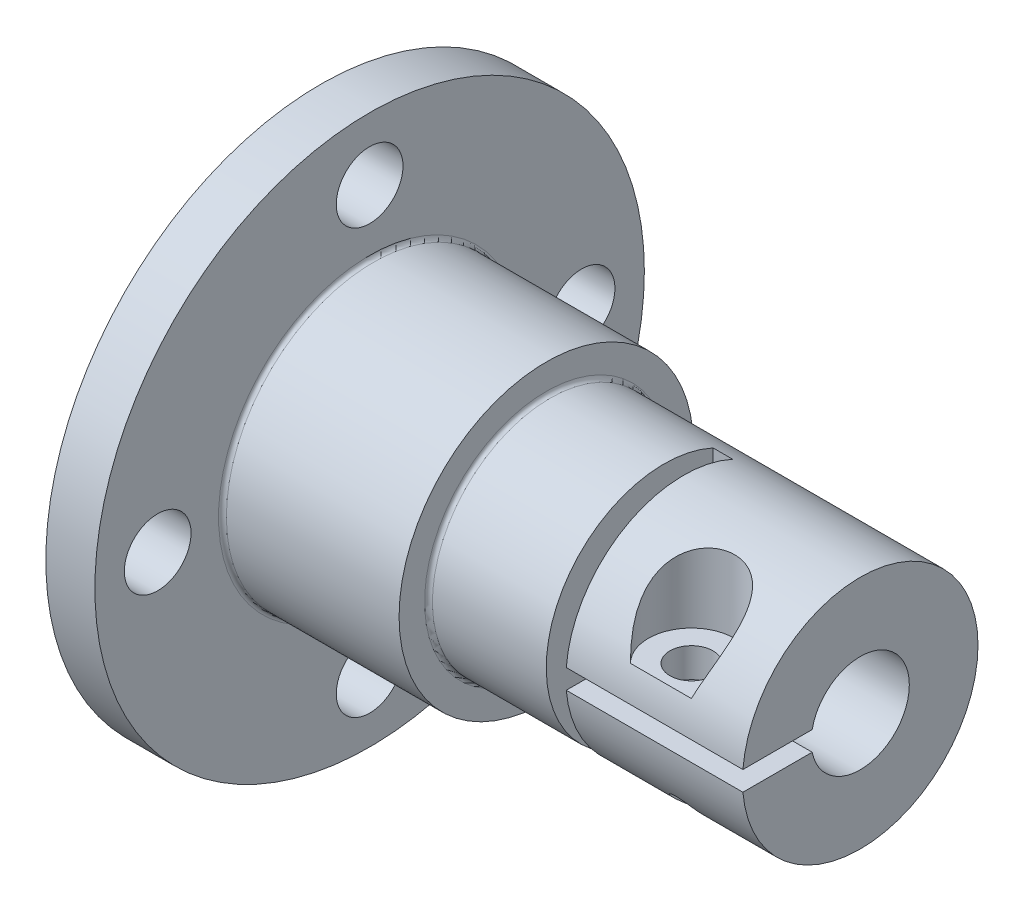
ISO-10303-21;
HEADER;
FILE_DESCRIPTION(('STEP AP214'),'2;1');
FILE_NAME('part.step','',(''),(''),'','','');
FILE_SCHEMA(('AUTOMOTIVE_DESIGN { 1 0 10303 214 1 1 1 1 }'));
ENDSEC;
DATA;
#1=APPLICATION_CONTEXT('core data for automotive mechanical design processes');
#2=APPLICATION_PROTOCOL_DEFINITION('international standard','automotive_design',2000,#1);
#3=PRODUCT_CONTEXT('',#1,'mechanical');
#4=PRODUCT('Part','Part','',(#3));
#5=PRODUCT_RELATED_PRODUCT_CATEGORY('part','',(#4));
#6=PRODUCT_DEFINITION_FORMATION('','',#4);
#7=PRODUCT_DEFINITION_CONTEXT('part definition',#1,'design');
#8=PRODUCT_DEFINITION('design','',#6,#7);
#9=PRODUCT_DEFINITION_SHAPE('','',#8);
#10=(LENGTH_UNIT() NAMED_UNIT(*) SI_UNIT(.MILLI.,.METRE.));
#11=(NAMED_UNIT(*) PLANE_ANGLE_UNIT() SI_UNIT($,.RADIAN.));
#12=(NAMED_UNIT(*) SI_UNIT($,.STERADIAN.) SOLID_ANGLE_UNIT());
#13=UNCERTAINTY_MEASURE_WITH_UNIT(LENGTH_MEASURE(1.E-05),#10,'distance_accuracy_value','');
#14=(GEOMETRIC_REPRESENTATION_CONTEXT(3) GLOBAL_UNCERTAINTY_ASSIGNED_CONTEXT((#13)) GLOBAL_UNIT_ASSIGNED_CONTEXT((#10,
#11,#12)) REPRESENTATION_CONTEXT('',''));
#15=CARTESIAN_POINT('',(0.,0.,0.));
#16=DIRECTION('',(0.,0.,1.));
#17=DIRECTION('',(1.,0.,0.));
#18=AXIS2_PLACEMENT_3D('',#15,#16,#17);
#19=CARTESIAN_POINT('',(5.,0.,0.));
#20=DIRECTION('',(1.,0.,0.));
#21=DIRECTION('',(0.,0.,-1.));
#22=AXIS2_PLACEMENT_3D('',#19,#20,#21);
#23=PLANE('',#22);
#24=CARTESIAN_POINT('',(5.,27.8,60.));
#25=DIRECTION('',(1.,0.,0.));
#26=DIRECTION('',(0.,0.,-1.));
#27=AXIS2_PLACEMENT_3D('',#24,#25,#26);
#28=CIRCLE('',#27,1.7);
#29=CARTESIAN_POINT('',(5.,27.8,58.3));
#30=VERTEX_POINT('',#29);
#31=EDGE_CURVE('E284',#30,#30,#28,.T.);
#32=ORIENTED_EDGE('',*,*,#31,.F.);
#33=EDGE_LOOP('',(#32));
#34=FACE_BOUND('',#33,.T.);
#35=CARTESIAN_POINT('',(5.,16.9999999999999,49.2));
#36=DIRECTION('',(1.,0.,0.));
#37=DIRECTION('',(0.,0.,-1.));
#38=AXIS2_PLACEMENT_3D('',#35,#36,#37);
#39=CIRCLE('',#38,1.7);
#40=CARTESIAN_POINT('',(5.,16.9999999999999,47.5));
#41=VERTEX_POINT('',#40);
#42=EDGE_CURVE('E281',#41,#41,#39,.T.);
#43=ORIENTED_EDGE('',*,*,#42,.F.);
#44=EDGE_LOOP('',(#43));
#45=FACE_BOUND('',#44,.T.);
#46=CARTESIAN_POINT('',(5.,6.2,60.0000000000001));
#47=DIRECTION('',(1.,0.,0.));
#48=DIRECTION('',(0.,0.,-1.));
#49=AXIS2_PLACEMENT_3D('',#46,#47,#48);
#50=CIRCLE('',#49,1.7);
#51=CARTESIAN_POINT('',(5.,6.2,58.3000000000001));
#52=VERTEX_POINT('',#51);
#53=EDGE_CURVE('E277',#52,#52,#50,.T.);
#54=ORIENTED_EDGE('',*,*,#53,.F.);
#55=EDGE_LOOP('',(#54));
#56=FACE_BOUND('',#55,.T.);
#57=CARTESIAN_POINT('',(5.,17.0000000000001,70.8));
#58=DIRECTION('',(1.,0.,0.));
#59=DIRECTION('',(0.,0.,-1.));
#60=AXIS2_PLACEMENT_3D('',#57,#58,#59);
#61=CIRCLE('',#60,1.7);
#62=CARTESIAN_POINT('',(5.,17.0000000000001,69.1));
#63=VERTEX_POINT('',#62);
#64=EDGE_CURVE('E271',#63,#63,#61,.T.);
#65=ORIENTED_EDGE('',*,*,#64,.F.);
#66=EDGE_LOOP('',(#65));
#67=FACE_BOUND('',#66,.T.);
#68=CARTESIAN_POINT('',(5.,17.,60.));
#69=DIRECTION('',(1.,0.,0.));
#70=DIRECTION('',(0.,0.,-1.));
#71=AXIS2_PLACEMENT_3D('',#68,#69,#70);
#72=CIRCLE('',#71,7.7);
#73=CARTESIAN_POINT('',(5.,17.,52.3));
#74=VERTEX_POINT('',#73);
#75=EDGE_CURVE('E120',#74,#74,#72,.F.);
#76=ORIENTED_EDGE('',*,*,#75,.T.);
#77=EDGE_LOOP('',(#76));
#78=FACE_BOUND('',#77,.T.);
#79=CARTESIAN_POINT('',(5.,17.,60.));
#80=DIRECTION('',(1.,0.,0.));
#81=DIRECTION('',(0.,0.,-1.));
#82=AXIS2_PLACEMENT_3D('',#79,#80,#81);
#83=CIRCLE('',#82,14.);
#84=CARTESIAN_POINT('',(5.,17.,46.));
#85=VERTEX_POINT('',#84);
#86=EDGE_CURVE('E267',#85,#85,#83,.T.);
#87=ORIENTED_EDGE('',*,*,#86,.T.);
#88=EDGE_LOOP('',(#87));
#89=FACE_BOUND('',#88,.T.);
#90=ADVANCED_FACE('F39',(#34,#45,#56,#67,#78,#89),#23,.T.);
#91=CARTESIAN_POINT('',(21.,17.5,0.));
#92=DIRECTION('',(0.,1.,0.));
#93=DIRECTION('',(0.,0.,1.));
#94=AXIS2_PLACEMENT_3D('',#91,#92,#93);
#95=PLANE('',#94);
#96=DIRECTION('',(0.,0.,1.));
#97=VECTOR('',#96,1.);
#98=CARTESIAN_POINT('',(30.,17.5,0.));
#99=LINE('',#98,#97);
#100=CARTESIAN_POINT('',(30.,17.5,62.4494897427832));
#101=VERTEX_POINT('',#100);
#102=CARTESIAN_POINT('',(30.,17.5,65.9791303715507));
#103=VERTEX_POINT('',#102);
#104=EDGE_CURVE('E230',#101,#103,#99,.T.);
#105=ORIENTED_EDGE('',*,*,#104,.T.);
#106=DIRECTION('',(1.,0.,0.));
#107=VECTOR('',#106,1.);
#108=CARTESIAN_POINT('',(21.,17.5,65.9791303715507));
#109=LINE('',#108,#107);
#110=CARTESIAN_POINT('',(21.,17.5,65.9791303715507));
#111=VERTEX_POINT('',#110);
#112=EDGE_CURVE('E226',#111,#103,#109,.T.);
#113=ORIENTED_EDGE('',*,*,#112,.F.);
#114=DIRECTION('',(0.,0.,1.));
#115=VECTOR('',#114,1.);
#116=CARTESIAN_POINT('',(21.,17.5,0.));
#117=LINE('',#116,#115);
#118=CARTESIAN_POINT('',(21.,17.5,62.4494897427832));
#119=VERTEX_POINT('',#118);
#120=EDGE_CURVE('E224',#119,#111,#117,.T.);
#121=ORIENTED_EDGE('',*,*,#120,.F.);
#122=DIRECTION('',(1.,0.,0.));
#123=VECTOR('',#122,1.);
#124=CARTESIAN_POINT('',(21.,17.5,62.4494897427832));
#125=LINE('',#124,#123);
#126=EDGE_CURVE('E223',#119,#101,#125,.T.);
#127=ORIENTED_EDGE('',*,*,#126,.T.);
#128=EDGE_LOOP('',(#105,#113,#121,#127));
#129=FACE_BOUND('',#128,.T.);
#130=CARTESIAN_POINT('',(25.5,17.5,64.1));
#131=DIRECTION('',(0.,1.,0.));
#132=DIRECTION('',(0.,0.,1.));
#133=AXIS2_PLACEMENT_3D('',#130,#131,#132);
#134=CIRCLE('',#133,1.1);
#135=CARTESIAN_POINT('',(25.5,17.5,65.2));
#136=VERTEX_POINT('',#135);
#137=EDGE_CURVE('E260',#136,#136,#134,.F.);
#138=ORIENTED_EDGE('',*,*,#137,.F.);
#139=EDGE_LOOP('',(#138));
#140=FACE_BOUND('',#139,.T.);
#141=ADVANCED_FACE('F169',(#129,#140),#95,.F.);
#142=CARTESIAN_POINT('',(30.,17.,60.));
#143=DIRECTION('',(-1.,0.,0.));
#144=DIRECTION('',(0.,0.,1.));
#145=AXIS2_PLACEMENT_3D('',#142,#143,#144);
#146=CYLINDRICAL_SURFACE('',#145,6.);
#147=CARTESIAN_POINT('',(14.2,17.,60.));
#148=DIRECTION('',(1.,0.,0.));
#149=DIRECTION('',(0.,0.,-1.));
#150=AXIS2_PLACEMENT_3D('',#147,#148,#149);
#151=CIRCLE('',#150,6.);
#152=CARTESIAN_POINT('',(14.2,17.,54.));
#153=VERTEX_POINT('',#152);
#154=EDGE_CURVE('E451',#153,#153,#151,.T.);
#155=ORIENTED_EDGE('',*,*,#154,.T.);
#156=EDGE_LOOP('',(#155));
#157=FACE_BOUND('',#156,.T.);
#158=CARTESIAN_POINT('',(25.5,13.5373420613638,64.9));
#159=CARTESIAN_POINT('',(25.5326910598529,13.5373358261282,64.8999960831288));
#160=CARTESIAN_POINT('',(25.5654413604297,13.5344596757837,64.8979670005085));
#161=CARTESIAN_POINT('',(25.6295824931057,13.5233728538796,64.8901028186996));
#162=CARTESIAN_POINT('',(25.6609686036178,13.5151450196477,64.8842554742345));
#163=CARTESIAN_POINT('',(25.7210279802254,13.4945231042613,64.8694751126386));
#164=CARTESIAN_POINT('',(25.7497314549821,13.4821851441088,64.8605836182522));
#165=CARTESIAN_POINT('',(25.8045790675066,13.4543676173585,64.840329386584));
#166=CARTESIAN_POINT('',(25.8307227886647,13.438887540625,64.828966247999));
#167=CARTESIAN_POINT('',(25.8967939777907,13.3947568004842,64.7961841262141));
#168=CARTESIAN_POINT('',(25.9345369496735,13.3641195411807,64.7730528189364));
#169=CARTESIAN_POINT('',(26.003812646507,13.2992031672132,64.7229024486574));
#170=CARTESIAN_POINT('',(26.0353252437258,13.264912782615,64.6958712579704));
#171=CARTESIAN_POINT('',(26.1075638571252,13.1760248874167,64.6240592509601));
#172=CARTESIAN_POINT('',(26.1446679248419,13.1200696438822,64.5773106045231));
#173=CARTESIAN_POINT('',(26.2072096740054,13.0064219896725,64.478508854471));
#174=CARTESIAN_POINT('',(26.2326354419118,12.9487278687276,64.4264503999385));
#175=CARTESIAN_POINT('',(26.2723779951645,12.8318717444481,64.3166303674465));
#176=CARTESIAN_POINT('',(26.2863862384601,12.7727108903284,64.2587550946613));
#177=CARTESIAN_POINT('',(26.3012548368551,12.6560891268234,64.1397287512114));
#178=CARTESIAN_POINT('',(26.3021318254665,12.5986261588591,64.0785819232693));
#179=CARTESIAN_POINT('',(26.2905510698033,12.4989655565948,63.9679971067146));
#180=CARTESIAN_POINT('',(26.2808985232147,12.4561267836209,63.9188445001562));
#181=CARTESIAN_POINT('',(26.2514904426036,12.3735135399139,63.8209554622128));
#182=CARTESIAN_POINT('',(26.2317472872578,12.3337353831931,63.7722185951223));
#183=CARTESIAN_POINT('',(26.1864275894139,12.2661766058078,63.6869028600174));
#184=CARTESIAN_POINT('',(26.1628729684121,12.2376070462082,63.6498777330092));
#185=CARTESIAN_POINT('',(26.1085110487716,12.183923366862,63.5787404191828));
#186=CARTESIAN_POINT('',(26.0777119553254,12.1588053884221,63.5446249959237));
#187=CARTESIAN_POINT('',(26.014521881195,12.1165757564669,63.4861520476407));
#188=CARTESIAN_POINT('',(25.9831942733209,12.098826244029,63.4611087560935));
#189=CARTESIAN_POINT('',(25.9158712208695,12.0668512899427,63.4153802924156));
#190=CARTESIAN_POINT('',(25.8798771240256,12.0526248342358,63.3946938664841));
#191=CARTESIAN_POINT('',(25.8037460872294,12.0281199069179,63.358703439267));
#192=CARTESIAN_POINT('',(25.7635861836974,12.0178649733938,63.3434315722957));
#193=CARTESIAN_POINT('',(25.6805026289966,12.0018427020072,63.319433062768));
#194=CARTESIAN_POINT('',(25.6375804538601,11.9960729886549,63.3107029556133));
#195=CARTESIAN_POINT('',(25.5551693666994,11.9896302722449,63.3009429485867));
#196=CARTESIAN_POINT('',(25.5158015140529,11.9884800006123,63.2991921309115));
#197=CARTESIAN_POINT('',(25.437317874437,11.9899965771594,63.3014948261893));
#198=CARTESIAN_POINT('',(25.3982020106346,11.9926622005566,63.3055464767323));
#199=CARTESIAN_POINT('',(25.322973371998,12.0015270893209,63.3189348102506));
#200=CARTESIAN_POINT('',(25.2868031425671,12.0075786305373,63.3280504453591));
#201=CARTESIAN_POINT('',(25.2166977599896,12.0229094342441,63.3509338918796));
#202=CARTESIAN_POINT('',(25.1827628083457,12.0321889872566,63.3647021220237));
#203=CARTESIAN_POINT('',(25.1163669616373,12.054195404842,63.3969712027512));
#204=CARTESIAN_POINT('',(25.0840427773373,12.0670595610424,63.4156584158838));
#205=CARTESIAN_POINT('',(25.0231562800736,12.0956588211593,63.4565966996679));
#206=CARTESIAN_POINT('',(24.9945952227885,12.1113948792143,63.4788489544401));
#207=CARTESIAN_POINT('',(24.9383954972612,12.1473661638914,63.5288806718873));
#208=CARTESIAN_POINT('',(24.9112625654635,12.167913102395,63.5570024760446));
#209=CARTESIAN_POINT('',(24.8621632033993,12.211610599715,63.6156146062454));
#210=CARTESIAN_POINT('',(24.8402003340359,12.234762936883,63.6461065456137));
#211=CARTESIAN_POINT('',(24.7925411039535,12.2941775275479,63.7227018858328));
#212=CARTESIAN_POINT('',(24.769645566151,12.3316347373784,63.7696311085308));
#213=CARTESIAN_POINT('',(24.733757037872,12.4098616340749,63.8645100121978));
#214=CARTESIAN_POINT('',(24.7207829908232,12.4506374940029,63.9124614664944));
#215=CARTESIAN_POINT('',(24.7015447836342,12.545871133098,64.0208499501623));
#216=CARTESIAN_POINT('',(24.6980510379959,12.6010425774424,64.0811497456494));
#217=CARTESIAN_POINT('',(24.7039628583592,12.7134855426486,64.1991025624687));
#218=CARTESIAN_POINT('',(24.7133844200248,12.7707595820354,64.2567522101356));
#219=CARTESIAN_POINT('',(24.7442735665679,12.8866937432298,64.3689023303967));
#220=CARTESIAN_POINT('',(24.7659044222258,12.9453621044686,64.4233488355819));
#221=CARTESIAN_POINT('',(24.8210304500775,13.0616040926046,64.5271489547376));
#222=CARTESIAN_POINT('',(24.854510896208,13.1191789852547,64.5765087922933));
#223=CARTESIAN_POINT('',(24.9202819245679,13.2112786075036,64.6527236329753));
#224=CARTESIAN_POINT('',(24.9489481626604,13.2468646968726,64.6814413085947));
#225=CARTESIAN_POINT('',(25.01223590392,13.3152678792038,64.7354652022117));
#226=CARTESIAN_POINT('',(25.0468484891899,13.3480890105501,64.7607764290142));
#227=CARTESIAN_POINT('',(25.1113984239121,13.3998582949868,64.7999691161534));
#228=CARTESIAN_POINT('',(25.1396482268955,13.4200234370474,64.8150072942991));
#229=CARTESIAN_POINT('',(25.1996263575463,13.4568858541339,64.8421961712071));
#230=CARTESIAN_POINT('',(25.23134950442,13.4735881893954,64.8543510871112));
#231=CARTESIAN_POINT('',(25.2899939480314,13.4985821438833,64.8723969224606));
#232=CARTESIAN_POINT('',(25.3162125521176,13.5079312071525,64.8790921322415));
#233=CARTESIAN_POINT('',(25.370156437459,13.5230358845441,64.8898679103582));
#234=CARTESIAN_POINT('',(25.3978774931895,13.5288010604929,64.8939554367765));
#235=CARTESIAN_POINT('',(25.4382149957321,13.53409742303,64.8977058475826));
#236=CARTESIAN_POINT('',(25.450521456086,13.5353105141234,64.8985638755571));
#237=CARTESIAN_POINT('',(25.4752157577013,13.5369341221041,64.8997117698791));
#238=CARTESIAN_POINT('',(25.4876036197084,13.5373444257519,64.9000014852692));
#239=CARTESIAN_POINT('',(25.5,13.5373420613638,64.9));
#240=B_SPLINE_CURVE_WITH_KNOTS('',3,(#158,#159,#160,#161,#162,#163,#164,#165,#166,#167,#168,
#169,#170,#171,#172,#173,#174,#175,#176,#177,#178,#179,#180,#181,#182,#183,#184,#185,#186,#187,
#188,#189,#190,#191,#192,#193,#194,#195,#196,#197,#198,#199,#200,#201,#202,#203,#204,#205,#206,
#207,#208,#209,#210,#211,#212,#213,#214,#215,#216,#217,#218,#219,#220,#221,#222,#223,#224,#225,
#226,#227,#228,#229,#230,#231,#232,#233,#234,#235,#236,#237,#238,#239),.UNSPECIFIED.,.T.,.F.,(4,
2,2,2,2,2,2,2,2,2,2,2,2,2,2,2,2,2,2,2,2,2,2,2,2,2,2,2,2,2,2,2,2,2,2,2,2,2,2,2,4),(0.,
0.0980044215290841,0.196324700009352,0.293354039362897,0.390399144451718,0.550992383424809,
0.712096246020463,0.956230462260393,1.20061318025828,1.45139938239139,1.70186788383303,
1.89889600485294,2.09568299927443,2.25217995180785,2.4085004999854,2.53953503013011,
2.67053180001914,2.80229348463062,2.93398533717623,3.05165505604012,3.16928701508618,
3.28214737080922,3.39501788663556,3.51300883852875,3.63103906241896,3.76298468546013,
3.89502092245226,4.08674784868779,4.27883993769077,4.5229779133623,4.76741852830734,
5.01520815791879,5.26269092236209,5.4242311870132,5.58553126717295,5.69869290782906,
5.8116880001556,5.89726447377946,5.98261163792293,6.01976483846105,6.05692790643729),.UNSPECIFIED.);
#241=CARTESIAN_POINT('',(25.5,13.5373420613638,64.9));
#242=VERTEX_POINT('',#241);
#243=EDGE_CURVE('E113',#242,#242,#240,.T.);
#244=ORIENTED_EDGE('',*,*,#243,.T.);
#245=EDGE_LOOP('',(#244));
#246=FACE_BOUND('',#245,.T.);
#247=CARTESIAN_POINT('',(23.9455853687521,19.,65.6568542494924));
#248=CARTESIAN_POINT('',(23.9172460097947,19.0800006925904,65.6285651972429));
#249=CARTESIAN_POINT('',(23.8887909083147,19.1593571644015,65.5986037299058));
#250=CARTESIAN_POINT('',(23.8321521031906,19.3168253437857,65.5352990071714));
#251=CARTESIAN_POINT('',(23.8039684473754,19.3949368335243,65.5019551673158));
#252=CARTESIAN_POINT('',(23.7203692755019,19.6280552136032,65.396526599237));
#253=CARTESIAN_POINT('',(23.6661431437885,19.7811990378514,65.3192731313046));
#254=CARTESIAN_POINT('',(23.5638786657281,20.0843864323576,65.1494858177814));
#255=CARTESIAN_POINT('',(23.5159488701835,20.2343455422945,65.0567343217611));
#256=CARTESIAN_POINT('',(23.4314414188554,20.5273807495183,64.8568451441069));
#257=CARTESIAN_POINT('',(23.3948397008268,20.6704708830732,64.7497386579799));
#258=CARTESIAN_POINT('',(23.3380362790862,20.9458699351821,64.5234142050623));
#259=CARTESIAN_POINT('',(23.3175455244457,21.0783286671214,64.4044550130077));
#260=CARTESIAN_POINT('',(23.2971357554518,21.3324473597698,64.1546832756087));
#261=CARTESIAN_POINT('',(23.2971216710671,21.4541546023724,64.0239283280407));
#262=CARTESIAN_POINT('',(23.3211500192023,21.6660831894942,63.7749205044664));
#263=CARTESIAN_POINT('',(23.3413817751672,21.758238056923,63.6579685895926));
#264=CARTESIAN_POINT('',(23.403743540656,21.9311361502161,63.4212988545483));
#265=CARTESIAN_POINT('',(23.4458640211855,22.0118843224094,63.3015822596016));
#266=CARTESIAN_POINT('',(23.5460015109525,22.1486205132488,63.0831326998661));
#267=CARTESIAN_POINT('',(23.6005652442604,22.2065065440826,62.9840109163668));
#268=CARTESIAN_POINT('',(23.727457474178,22.3120364427293,62.7918226558323));
#269=CARTESIAN_POINT('',(23.7997788620368,22.3596843947764,62.6987537745086));
#270=CARTESIAN_POINT('',(23.9616025731061,22.4447471588194,62.5227650782706));
#271=CARTESIAN_POINT('',(24.0511643776819,22.4821254228163,62.4398820767954));
#272=CARTESIAN_POINT('',(24.2451150885593,22.546897997321,62.2888220159677));
#273=CARTESIAN_POINT('',(24.3495037111063,22.5742924988615,62.2206446752422));
#274=CARTESIAN_POINT('',(24.5627096580656,22.6184861451347,62.1062157028713));
#275=CARTESIAN_POINT('',(24.6708026722991,22.635856445182,62.0588302952898));
#276=CARTESIAN_POINT('',(24.8939989030437,22.6633984095729,61.9818181346854));
#277=CARTESIAN_POINT('',(25.0091012636545,22.6735709509168,61.952189218216));
#278=CARTESIAN_POINT('',(25.2413323006005,22.687197470238,61.9121271329164));
#279=CARTESIAN_POINT('',(25.3584110334964,22.6907423015815,61.9014344927658));
#280=CARTESIAN_POINT('',(25.5928006544651,22.6916100109298,61.8988360041131));
#281=CARTESIAN_POINT('',(25.7101115402583,22.6889329497262,61.9069299720549));
#282=CARTESIAN_POINT('',(25.9417552993547,22.6771842811697,61.9416254821625));
#283=CARTESIAN_POINT('',(26.0560851215442,22.6681063699156,61.9682452692146));
#284=CARTESIAN_POINT('',(26.2783839725321,22.6430379302806,62.0389999994213));
#285=CARTESIAN_POINT('',(26.386353409861,22.627047846423,62.0831338162297));
#286=CARTESIAN_POINT('',(26.592777600508,22.5874552415341,62.1871027731155));
#287=CARTESIAN_POINT('',(26.6912424695034,22.5638609323721,62.246920962568));
#288=CARTESIAN_POINT('',(26.8761452783647,22.5083433788116,62.3797724242026));
#289=CARTESIAN_POINT('',(26.9625844075974,22.476420958977,62.4528043878733));
#290=CARTESIAN_POINT('',(27.122100870086,22.4034872599975,62.6095663295287));
#291=CARTESIAN_POINT('',(27.195069186784,22.3624073012088,62.6933750068598));
#292=CARTESIAN_POINT('',(27.3257278923423,22.2712457482171,62.8676880974195));
#293=CARTESIAN_POINT('',(27.3834161611717,22.2211629065254,62.9581934375506));
#294=CARTESIAN_POINT('',(27.4861759902884,22.1094245622019,63.1474593438883));
#295=CARTESIAN_POINT('',(27.5303822400023,22.0472850618702,63.2464004459285));
#296=CARTESIAN_POINT('',(27.602672623898,21.9143393918075,63.4443422821584));
#297=CARTESIAN_POINT('',(27.6307478452377,21.843528457028,63.5433430191174));
#298=CARTESIAN_POINT('',(27.6666631652576,21.7150274714282,63.7116646022225));
#299=CARTESIAN_POINT('',(27.6779483071328,21.6591036279762,63.7816418878274));
#300=CARTESIAN_POINT('',(27.6936776036614,21.5437675466288,63.91947245699));
#301=CARTESIAN_POINT('',(27.6981192743756,21.4843540502312,63.9873249605764));
#302=CARTESIAN_POINT('',(27.7023114866724,21.3013326838767,64.1870118621917));
#303=CARTESIAN_POINT('',(27.6929037166032,21.173046759621,64.3148406983649));
#304=CARTESIAN_POINT('',(27.6606715191727,20.9439487698666,64.5235282932769));
#305=CARTESIAN_POINT('',(27.6422650441785,20.8453222898624,64.6076154471031));
#306=CARTESIAN_POINT('',(27.5976370652075,20.6439098599582,64.7684925828821));
#307=CARTESIAN_POINT('',(27.5714115537968,20.5411218005564,64.8452787962561));
#308=CARTESIAN_POINT('',(27.4835154822768,20.2271822872403,65.06463600002));
#309=CARTESIAN_POINT('',(27.412664435968,20.0106784825766,65.1960042726809));
#310=CARTESIAN_POINT('',(27.2912398800787,19.6605487719524,65.3798282415838));
#311=CARTESIAN_POINT('',(27.2447140446572,19.530472316721,65.4422006750514));
#312=CARTESIAN_POINT('',(27.1501747865052,19.2675178594489,65.556858046427));
#313=CARTESIAN_POINT('',(27.102172268379,19.1346619986585,65.6092026462422));
#314=CARTESIAN_POINT('',(27.0544146312479,19.,65.6568542494924));
#315=B_SPLINE_CURVE_WITH_KNOTS('',3,(#247,#248,#249,#250,#251,#252,#253,#254,#255,#256,#257,
#258,#259,#260,#261,#262,#263,#264,#265,#266,#267,#268,#269,#270,#271,#272,#273,#274,#275,#276,
#277,#278,#279,#280,#281,#282,#283,#284,#285,#286,#287,#288,#289,#290,#291,#292,#293,#294,#295,
#296,#297,#298,#299,#300,#301,#302,#303,#304,#305,#306,#307,#308,#309,#310,#311,#312,#313,#314),
.UNSPECIFIED.,.F.,.F.,(4,2,2,2,2,2,2,2,2,2,2,2,2,2,2,2,2,2,2,2,2,2,2,2,2,2,2,2,2,2,2,2,2,4),(0.,
0.26834714246317,0.536740733300531,1.07569956745189,1.62298569977411,2.16910122082248,
2.70517973283582,3.23876930676615,3.68782769535273,4.13669075530958,4.51633127548198,
4.8958200648951,5.27664239150379,5.65745743094378,6.01361690535165,6.36973297655272,
6.72093052755799,7.07212464717252,7.42366512560912,7.7751829997597,8.12632253154852,
8.47742731029598,8.83125961976626,9.1851409960281,9.55842767834278,9.9319204140883,
10.2024230344321,10.4730238146002,11.0147336286093,11.4069807692624,11.7994292920988,
12.585224354639,13.0396654286373,13.4913125242298),.UNSPECIFIED.);
#316=CARTESIAN_POINT('',(23.9455853687521,19.,65.6568542494924));
#317=VERTEX_POINT('',#316);
#318=CARTESIAN_POINT('',(27.0544146312479,19.,65.6568542494924));
#319=VERTEX_POINT('',#318);
#320=EDGE_CURVE('E103',#317,#319,#315,.T.);
#321=ORIENTED_EDGE('',*,*,#320,.T.);
#322=DIRECTION('',(-1.,0.,0.));
#323=VECTOR('',#322,1.);
#324=CARTESIAN_POINT('',(30.,19.,65.6568542494924));
#325=LINE('',#324,#323);
#326=EDGE_CURVE('E107',#319,#317,#325,.T.);
#327=ORIENTED_EDGE('',*,*,#326,.T.);
#328=EDGE_LOOP('',(#321,#327));
#329=FACE_BOUND('',#328,.T.);
#330=CARTESIAN_POINT('',(21.,17.,60.));
#331=DIRECTION('',(1.,0.,0.));
#332=DIRECTION('',(0.,0.,-1.));
#333=AXIS2_PLACEMENT_3D('',#330,#331,#332);
#334=CIRCLE('',#333,6.);
#335=CARTESIAN_POINT('',(21.,22.4543560573179,57.5));
#336=VERTEX_POINT('',#335);
#337=EDGE_CURVE('E239',#336,#111,#334,.T.);
#338=ORIENTED_EDGE('',*,*,#337,.T.);
#339=ORIENTED_EDGE('',*,*,#112,.T.);
#340=CARTESIAN_POINT('',(30.,17.,60.));
#341=DIRECTION('',(1.,0.,0.));
#342=DIRECTION('',(0.,0.,-1.));
#343=AXIS2_PLACEMENT_3D('',#340,#341,#342);
#344=CIRCLE('',#343,6.);
#345=CARTESIAN_POINT('',(30.,16.5,65.9791303715507));
#346=VERTEX_POINT('',#345);
#347=EDGE_CURVE('E214',#346,#103,#344,.T.);
#348=ORIENTED_EDGE('',*,*,#347,.F.);
#349=DIRECTION('',(1.,0.,0.));
#350=VECTOR('',#349,1.);
#351=CARTESIAN_POINT('',(21.,16.5,65.9791303715507));
#352=LINE('',#351,#350);
#353=CARTESIAN_POINT('',(21.,16.5,65.9791303715507));
#354=VERTEX_POINT('',#353);
#355=EDGE_CURVE('E217',#354,#346,#352,.T.);
#356=ORIENTED_EDGE('',*,*,#355,.F.);
#357=CARTESIAN_POINT('',(21.,11.5456439426821,57.5));
#358=VERTEX_POINT('',#357);
#359=EDGE_CURVE('E248',#354,#358,#334,.T.);
#360=ORIENTED_EDGE('',*,*,#359,.T.);
#361=DIRECTION('',(-1.,0.,0.));
#362=VECTOR('',#361,1.);
#363=CARTESIAN_POINT('',(30.,11.5456439426821,57.5));
#364=LINE('',#363,#362);
#365=CARTESIAN_POINT('',(20.,11.5456439426821,57.5));
#366=VERTEX_POINT('',#365);
#367=EDGE_CURVE('E253',#366,#358,#364,.F.);
#368=ORIENTED_EDGE('',*,*,#367,.F.);
#369=CARTESIAN_POINT('',(20.,17.,60.));
#370=DIRECTION('',(-1.,0.,0.));
#371=DIRECTION('',(0.,0.,1.));
#372=AXIS2_PLACEMENT_3D('',#369,#370,#371);
#373=CIRCLE('',#372,6.);
#374=CARTESIAN_POINT('',(20.,22.4543560573179,57.5));
#375=VERTEX_POINT('',#374);
#376=EDGE_CURVE('E108',#366,#375,#373,.T.);
#377=ORIENTED_EDGE('',*,*,#376,.T.);
#378=DIRECTION('',(-1.,0.,0.));
#379=VECTOR('',#378,1.);
#380=CARTESIAN_POINT('',(30.,22.4543560573179,57.5));
#381=LINE('',#380,#379);
#382=EDGE_CURVE('E250',#336,#375,#381,.T.);
#383=ORIENTED_EDGE('',*,*,#382,.F.);
#384=EDGE_LOOP('',(#338,#339,#348,#356,#360,#368,#377,#383));
#385=FACE_BOUND('',#384,.T.);
#386=ADVANCED_FACE('F115',(#157,#246,#329,#385),#146,.T.);
#387=CARTESIAN_POINT('',(30.,17.,60.));
#388=DIRECTION('',(1.,0.,0.));
#389=DIRECTION('',(0.,0.,-1.));
#390=AXIS2_PLACEMENT_3D('',#387,#388,#389);
#391=PLANE('',#390);
#392=CARTESIAN_POINT('',(30.,17.,60.));
#393=DIRECTION('',(1.,0.,0.));
#394=DIRECTION('',(0.,0.,-1.));
#395=AXIS2_PLACEMENT_3D('',#392,#393,#394);
#396=CIRCLE('',#395,2.5);
#397=CARTESIAN_POINT('',(30.,16.5,62.4494897427832));
#398=VERTEX_POINT('',#397);
#399=EDGE_CURVE('E233',#398,#101,#396,.T.);
#400=ORIENTED_EDGE('',*,*,#399,.F.);
#401=DIRECTION('',(0.,0.,1.));
#402=VECTOR('',#401,1.);
#403=CARTESIAN_POINT('',(30.,16.5,0.));
#404=LINE('',#403,#402);
#405=EDGE_CURVE('E236',#398,#346,#404,.T.);
#406=ORIENTED_EDGE('',*,*,#405,.T.);
#407=ORIENTED_EDGE('',*,*,#347,.T.);
#408=ORIENTED_EDGE('',*,*,#104,.F.);
#409=EDGE_LOOP('',(#400,#406,#407,#408));
#410=FACE_BOUND('',#409,.T.);
#411=ADVANCED_FACE('F180',(#410),#391,.T.);
#412=CARTESIAN_POINT('',(14.,17.,60.));
#413=DIRECTION('',(-1.,0.,0.));
#414=DIRECTION('',(0.,0.,1.));
#415=AXIS2_PLACEMENT_3D('',#412,#413,#414);
#416=CYLINDRICAL_SURFACE('',#415,7.5);
#417=CARTESIAN_POINT('',(5.2,17.,60.));
#418=DIRECTION('',(1.,0.,0.));
#419=DIRECTION('',(0.,0.,-1.));
#420=AXIS2_PLACEMENT_3D('',#417,#418,#419);
#421=CIRCLE('',#420,7.5);
#422=CARTESIAN_POINT('',(5.2,17.,52.5));
#423=VERTEX_POINT('',#422);
#424=EDGE_CURVE('E117',#423,#423,#421,.T.);
#425=ORIENTED_EDGE('',*,*,#424,.T.);
#426=EDGE_LOOP('',(#425));
#427=FACE_BOUND('',#426,.T.);
#428=CARTESIAN_POINT('',(14.,17.,60.));
#429=DIRECTION('',(1.,0.,0.));
#430=DIRECTION('',(0.,0.,-1.));
#431=AXIS2_PLACEMENT_3D('',#428,#429,#430);
#432=CIRCLE('',#431,7.5);
#433=CARTESIAN_POINT('',(14.,17.,52.5));
#434=VERTEX_POINT('',#433);
#435=EDGE_CURVE('E212',#434,#434,#432,.T.);
#436=ORIENTED_EDGE('',*,*,#435,.F.);
#437=EDGE_LOOP('',(#436));
#438=FACE_BOUND('',#437,.T.);
#439=ADVANCED_FACE('F182',(#427,#438),#416,.T.);
#440=CARTESIAN_POINT('',(14.,0.,0.));
#441=DIRECTION('',(1.,0.,0.));
#442=DIRECTION('',(0.,0.,-1.));
#443=AXIS2_PLACEMENT_3D('',#440,#441,#442);
#444=PLANE('',#443);
#445=CARTESIAN_POINT('',(14.,17.,60.));
#446=DIRECTION('',(1.,0.,0.));
#447=DIRECTION('',(0.,0.,-1.));
#448=AXIS2_PLACEMENT_3D('',#445,#446,#447);
#449=CIRCLE('',#448,6.2);
#450=CARTESIAN_POINT('',(14.,17.,53.8));
#451=VERTEX_POINT('',#450);
#452=EDGE_CURVE('E48',#451,#451,#449,.F.);
#453=ORIENTED_EDGE('',*,*,#452,.T.);
#454=EDGE_LOOP('',(#453));
#455=FACE_BOUND('',#454,.T.);
#456=ORIENTED_EDGE('',*,*,#435,.T.);
#457=EDGE_LOOP('',(#456));
#458=FACE_BOUND('',#457,.T.);
#459=ADVANCED_FACE('F178',(#455,#458),#444,.T.);
#460=CARTESIAN_POINT('',(21.,16.5,0.));
#461=DIRECTION('',(0.,1.,0.));
#462=DIRECTION('',(0.,0.,1.));
#463=AXIS2_PLACEMENT_3D('',#460,#461,#462);
#464=PLANE('',#463);
#465=CARTESIAN_POINT('',(25.5,16.5,64.1));
#466=DIRECTION('',(0.,1.,0.));
#467=DIRECTION('',(0.,0.,1.));
#468=AXIS2_PLACEMENT_3D('',#465,#466,#467);
#469=CIRCLE('',#468,0.799999999999999);
#470=CARTESIAN_POINT('',(25.5,16.5,64.9));
#471=VERTEX_POINT('',#470);
#472=EDGE_CURVE('E133',#471,#471,#469,.T.);
#473=ORIENTED_EDGE('',*,*,#472,.F.);
#474=EDGE_LOOP('',(#473));
#475=FACE_BOUND('',#474,.T.);
#476=ORIENTED_EDGE('',*,*,#405,.F.);
#477=DIRECTION('',(1.,0.,0.));
#478=VECTOR('',#477,1.);
#479=CARTESIAN_POINT('',(21.,16.5,62.4494897427832));
#480=LINE('',#479,#478);
#481=CARTESIAN_POINT('',(21.,16.5,62.4494897427832));
#482=VERTEX_POINT('',#481);
#483=EDGE_CURVE('E220',#482,#398,#480,.T.);
#484=ORIENTED_EDGE('',*,*,#483,.F.);
#485=DIRECTION('',(0.,0.,1.));
#486=VECTOR('',#485,1.);
#487=CARTESIAN_POINT('',(21.,16.5,0.));
#488=LINE('',#487,#486);
#489=EDGE_CURVE('E232',#482,#354,#488,.T.);
#490=ORIENTED_EDGE('',*,*,#489,.T.);
#491=ORIENTED_EDGE('',*,*,#355,.T.);
#492=EDGE_LOOP('',(#476,#484,#490,#491));
#493=FACE_BOUND('',#492,.T.);
#494=ADVANCED_FACE('F175',(#475,#493),#464,.T.);
#495=CARTESIAN_POINT('',(21.,17.,60.));
#496=DIRECTION('',(1.,0.,0.));
#497=DIRECTION('',(0.,0.,-1.));
#498=AXIS2_PLACEMENT_3D('',#495,#496,#497);
#499=CYLINDRICAL_SURFACE('',#498,2.5);
#500=ORIENTED_EDGE('',*,*,#399,.T.);
#501=ORIENTED_EDGE('',*,*,#126,.F.);
#502=CARTESIAN_POINT('',(21.,17.,60.));
#503=DIRECTION('',(1.,0.,0.));
#504=DIRECTION('',(0.,0.,-1.));
#505=AXIS2_PLACEMENT_3D('',#502,#503,#504);
#506=CIRCLE('',#505,2.5);
#507=CARTESIAN_POINT('',(21.,17.,57.5));
#508=VERTEX_POINT('',#507);
#509=EDGE_CURVE('E245',#508,#119,#506,.T.);
#510=ORIENTED_EDGE('',*,*,#509,.F.);
#511=EDGE_CURVE('E242',#482,#508,#506,.T.);
#512=ORIENTED_EDGE('',*,*,#511,.F.);
#513=ORIENTED_EDGE('',*,*,#483,.T.);
#514=EDGE_LOOP('',(#500,#501,#510,#512,#513));
#515=FACE_BOUND('',#514,.T.);
#516=ADVANCED_FACE('F164',(#515),#499,.F.);
#517=CARTESIAN_POINT('',(20.,11.,57.5));
#518=DIRECTION('',(-1.,0.,0.));
#519=DIRECTION('',(0.,0.,1.));
#520=AXIS2_PLACEMENT_3D('',#517,#518,#519);
#521=PLANE('',#520);
#522=DIRECTION('',(0.,-1.,0.));
#523=VECTOR('',#522,1.);
#524=CARTESIAN_POINT('',(20.,11.,57.5));
#525=LINE('',#524,#523);
#526=EDGE_CURVE('E255',#375,#366,#525,.T.);
#527=ORIENTED_EDGE('',*,*,#526,.F.);
#528=ORIENTED_EDGE('',*,*,#376,.F.);
#529=EDGE_LOOP('',(#527,#528));
#530=FACE_BOUND('',#529,.T.);
#531=ADVANCED_FACE('F160',(#530),#521,.F.);
#532=CARTESIAN_POINT('',(21.,11.,57.5));
#533=DIRECTION('',(1.,0.,0.));
#534=DIRECTION('',(0.,0.,-1.));
#535=AXIS2_PLACEMENT_3D('',#532,#533,#534);
#536=PLANE('',#535);
#537=ORIENTED_EDGE('',*,*,#359,.F.);
#538=ORIENTED_EDGE('',*,*,#489,.F.);
#539=ORIENTED_EDGE('',*,*,#511,.T.);
#540=DIRECTION('',(0.,1.,0.));
#541=VECTOR('',#540,1.);
#542=CARTESIAN_POINT('',(21.,11.,57.5));
#543=LINE('',#542,#541);
#544=EDGE_CURVE('E63',#358,#508,#543,.T.);
#545=ORIENTED_EDGE('',*,*,#544,.F.);
#546=EDGE_LOOP('',(#537,#538,#539,#545));
#547=FACE_BOUND('',#546,.T.);
#548=ADVANCED_FACE('F163',(#547),#536,.F.);
#549=EDGE_CURVE('E258',#508,#336,#543,.T.);
#550=ORIENTED_EDGE('',*,*,#549,.F.);
#551=ORIENTED_EDGE('',*,*,#509,.T.);
#552=ORIENTED_EDGE('',*,*,#120,.T.);
#553=ORIENTED_EDGE('',*,*,#337,.F.);
#554=EDGE_LOOP('',(#550,#551,#552,#553));
#555=FACE_BOUND('',#554,.T.);
#556=ADVANCED_FACE('F159',(#555),#536,.F.);
#557=CARTESIAN_POINT('',(0.,0.,57.5));
#558=DIRECTION('',(0.,0.,1.));
#559=DIRECTION('',(1.,0.,0.));
#560=AXIS2_PLACEMENT_3D('',#557,#558,#559);
#561=PLANE('',#560);
#562=ORIENTED_EDGE('',*,*,#382,.T.);
#563=ORIENTED_EDGE('',*,*,#526,.T.);
#564=ORIENTED_EDGE('',*,*,#367,.T.);
#565=ORIENTED_EDGE('',*,*,#544,.T.);
#566=ORIENTED_EDGE('',*,*,#549,.T.);
#567=EDGE_LOOP('',(#562,#563,#564,#565,#566));
#568=FACE_BOUND('',#567,.T.);
#569=ADVANCED_FACE('F152',(#568),#561,.T.);
#570=CARTESIAN_POINT('',(26.6,19.,64.1));
#571=DIRECTION('',(0.,-1.,0.));
#572=DIRECTION('',(0.,0.,-1.));
#573=AXIS2_PLACEMENT_3D('',#570,#571,#572);
#574=PLANE('',#573);
#575=CARTESIAN_POINT('',(25.5,19.,64.1));
#576=DIRECTION('',(0.,1.,0.));
#577=DIRECTION('',(0.,0.,1.));
#578=AXIS2_PLACEMENT_3D('',#575,#576,#577);
#579=CIRCLE('',#578,1.1);
#580=CARTESIAN_POINT('',(25.5,19.,65.2));
#581=VERTEX_POINT('',#580);
#582=EDGE_CURVE('E112',#581,#581,#579,.T.);
#583=ORIENTED_EDGE('',*,*,#582,.F.);
#584=EDGE_LOOP('',(#583));
#585=FACE_BOUND('',#584,.T.);
#586=CARTESIAN_POINT('',(25.5,19.,64.1));
#587=DIRECTION('',(0.,1.,0.));
#588=DIRECTION('',(0.,0.,1.));
#589=AXIS2_PLACEMENT_3D('',#586,#587,#588);
#590=CIRCLE('',#589,2.2);
#591=EDGE_CURVE('E55',#319,#317,#590,.T.);
#592=ORIENTED_EDGE('',*,*,#591,.T.);
#593=ORIENTED_EDGE('',*,*,#326,.F.);
#594=EDGE_LOOP('',(#592,#593));
#595=FACE_BOUND('',#594,.T.);
#596=ADVANCED_FACE('F111',(#585,#595),#574,.F.);
#597=CARTESIAN_POINT('',(25.5,23.,64.1));
#598=DIRECTION('',(0.,1.,0.));
#599=DIRECTION('',(0.,0.,1.));
#600=AXIS2_PLACEMENT_3D('',#597,#598,#599);
#601=CYLINDRICAL_SURFACE('',#600,2.2);
#602=ORIENTED_EDGE('',*,*,#591,.F.);
#603=ORIENTED_EDGE('',*,*,#320,.F.);
#604=EDGE_LOOP('',(#602,#603));
#605=FACE_BOUND('',#604,.T.);
#606=ADVANCED_FACE('F104',(#605),#601,.F.);
#607=CARTESIAN_POINT('',(25.5,23.,64.1));
#608=DIRECTION('',(0.,1.,0.));
#609=DIRECTION('',(0.,0.,1.));
#610=AXIS2_PLACEMENT_3D('',#607,#608,#609);
#611=CYLINDRICAL_SURFACE('',#610,1.1);
#612=ORIENTED_EDGE('',*,*,#137,.T.);
#613=EDGE_LOOP('',(#612));
#614=FACE_BOUND('',#613,.T.);
#615=ORIENTED_EDGE('',*,*,#582,.T.);
#616=EDGE_LOOP('',(#615));
#617=FACE_BOUND('',#616,.T.);
#618=ADVANCED_FACE('F143',(#614,#617),#611,.F.);
#619=CARTESIAN_POINT('',(25.5,16.5,64.1));
#620=DIRECTION('',(0.,1.,0.));
#621=DIRECTION('',(0.,0.,1.));
#622=AXIS2_PLACEMENT_3D('',#619,#620,#621);
#623=CYLINDRICAL_SURFACE('',#622,0.799999999999997);
#624=ORIENTED_EDGE('',*,*,#472,.T.);
#625=EDGE_LOOP('',(#624));
#626=FACE_BOUND('',#625,.T.);
#627=ORIENTED_EDGE('',*,*,#243,.F.);
#628=EDGE_LOOP('',(#627));
#629=FACE_BOUND('',#628,.T.);
#630=ADVANCED_FACE('F138',(#626,#629),#623,.F.);
#631=CARTESIAN_POINT('',(5.2,17.,60.));
#632=DIRECTION('',(1.,0.,0.));
#633=DIRECTION('',(0.,0.,-1.));
#634=AXIS2_PLACEMENT_3D('',#631,#632,#633);
#635=TOROIDAL_SURFACE('',#634,7.7,0.2);
#636=ORIENTED_EDGE('',*,*,#75,.F.);
#637=EDGE_LOOP('',(#636));
#638=FACE_BOUND('',#637,.T.);
#639=ORIENTED_EDGE('',*,*,#424,.F.);
#640=EDGE_LOOP('',(#639));
#641=FACE_BOUND('',#640,.T.);
#642=ADVANCED_FACE('F142',(#638,#641),#635,.F.);
#643=CARTESIAN_POINT('',(14.2,17.,60.));
#644=DIRECTION('',(1.,0.,0.));
#645=DIRECTION('',(0.,0.,-1.));
#646=AXIS2_PLACEMENT_3D('',#643,#644,#645);
#647=TOROIDAL_SURFACE('',#646,6.2,0.2);
#648=ORIENTED_EDGE('',*,*,#452,.F.);
#649=EDGE_LOOP('',(#648));
#650=FACE_BOUND('',#649,.T.);
#651=ORIENTED_EDGE('',*,*,#154,.F.);
#652=EDGE_LOOP('',(#651));
#653=FACE_BOUND('',#652,.T.);
#654=ADVANCED_FACE('F41',(#650,#653),#647,.F.);
#655=CARTESIAN_POINT('',(-5.,17.,60.));
#656=DIRECTION('',(1.,0.,0.));
#657=DIRECTION('',(0.,0.,-1.));
#658=AXIS2_PLACEMENT_3D('',#655,#656,#657);
#659=CYLINDRICAL_SURFACE('',#658,14.);
#660=CARTESIAN_POINT('',(2.5,17.,60.));
#661=DIRECTION('',(1.,0.,0.));
#662=DIRECTION('',(0.,0.,-1.));
#663=AXIS2_PLACEMENT_3D('',#660,#661,#662);
#664=CIRCLE('',#663,14.);
#665=CARTESIAN_POINT('',(2.5,17.,46.));
#666=VERTEX_POINT('',#665);
#667=EDGE_CURVE('E11',#666,#666,#664,.F.);
#668=ORIENTED_EDGE('',*,*,#667,.F.);
#669=EDGE_LOOP('',(#668));
#670=FACE_BOUND('',#669,.T.);
#671=ORIENTED_EDGE('',*,*,#86,.F.);
#672=EDGE_LOOP('',(#671));
#673=FACE_BOUND('',#672,.T.);
#674=ADVANCED_FACE('F145',(#670,#673),#659,.T.);
#675=CARTESIAN_POINT('',(2.5,3.,46.));
#676=DIRECTION('',(1.,0.,0.));
#677=DIRECTION('',(0.,0.,-1.));
#678=AXIS2_PLACEMENT_3D('',#675,#676,#677);
#679=PLANE('',#678);
#680=CARTESIAN_POINT('',(2.5,27.8,60.));
#681=DIRECTION('',(1.,0.,0.));
#682=DIRECTION('',(0.,0.,-1.));
#683=AXIS2_PLACEMENT_3D('',#680,#681,#682);
#684=CIRCLE('',#683,1.7);
#685=CARTESIAN_POINT('',(2.5,27.8,58.3));
#686=VERTEX_POINT('',#685);
#687=EDGE_CURVE('E43',#686,#686,#684,.T.);
#688=ORIENTED_EDGE('',*,*,#687,.T.);
#689=EDGE_LOOP('',(#688));
#690=FACE_BOUND('',#689,.T.);
#691=CARTESIAN_POINT('',(2.5,16.9999999999999,49.2));
#692=DIRECTION('',(1.,0.,0.));
#693=DIRECTION('',(0.,0.,-1.));
#694=AXIS2_PLACEMENT_3D('',#691,#692,#693);
#695=CIRCLE('',#694,1.7);
#696=CARTESIAN_POINT('',(2.5,16.9999999999999,47.5));
#697=VERTEX_POINT('',#696);
#698=EDGE_CURVE('E280',#697,#697,#695,.T.);
#699=ORIENTED_EDGE('',*,*,#698,.T.);
#700=EDGE_LOOP('',(#699));
#701=FACE_BOUND('',#700,.T.);
#702=CARTESIAN_POINT('',(2.5,6.2,60.0000000000001));
#703=DIRECTION('',(1.,0.,0.));
#704=DIRECTION('',(0.,0.,-1.));
#705=AXIS2_PLACEMENT_3D('',#702,#703,#704);
#706=CIRCLE('',#705,1.7);
#707=CARTESIAN_POINT('',(2.5,6.2,58.3000000000001));
#708=VERTEX_POINT('',#707);
#709=EDGE_CURVE('E274',#708,#708,#706,.T.);
#710=ORIENTED_EDGE('',*,*,#709,.T.);
#711=EDGE_LOOP('',(#710));
#712=FACE_BOUND('',#711,.T.);
#713=CARTESIAN_POINT('',(2.5,17.0000000000001,70.8));
#714=DIRECTION('',(1.,0.,0.));
#715=DIRECTION('',(0.,0.,-1.));
#716=AXIS2_PLACEMENT_3D('',#713,#714,#715);
#717=CIRCLE('',#716,1.7);
#718=CARTESIAN_POINT('',(2.5,17.0000000000001,69.1));
#719=VERTEX_POINT('',#718);
#720=EDGE_CURVE('E270',#719,#719,#717,.T.);
#721=ORIENTED_EDGE('',*,*,#720,.T.);
#722=EDGE_LOOP('',(#721));
#723=FACE_BOUND('',#722,.T.);
#724=ORIENTED_EDGE('',*,*,#667,.T.);
#725=EDGE_LOOP('',(#724));
#726=FACE_BOUND('',#725,.T.);
#727=ADVANCED_FACE('F290',(#690,#701,#712,#723,#726),#679,.F.);
#728=CARTESIAN_POINT('',(5.,17.0000000000001,70.8));
#729=DIRECTION('',(1.,0.,0.));
#730=DIRECTION('',(0.,0.,-1.));
#731=AXIS2_PLACEMENT_3D('',#728,#729,#730);
#732=CYLINDRICAL_SURFACE('',#731,1.7);
#733=ORIENTED_EDGE('',*,*,#64,.T.);
#734=EDGE_LOOP('',(#733));
#735=FACE_BOUND('',#734,.T.);
#736=ORIENTED_EDGE('',*,*,#720,.F.);
#737=EDGE_LOOP('',(#736));
#738=FACE_BOUND('',#737,.T.);
#739=ADVANCED_FACE('F306',(#735,#738),#732,.F.);
#740=CARTESIAN_POINT('',(5.,6.2,60.0000000000001));
#741=DIRECTION('',(1.,0.,0.));
#742=DIRECTION('',(0.,0.,-1.));
#743=AXIS2_PLACEMENT_3D('',#740,#741,#742);
#744=CYLINDRICAL_SURFACE('',#743,1.7);
#745=ORIENTED_EDGE('',*,*,#53,.T.);
#746=EDGE_LOOP('',(#745));
#747=FACE_BOUND('',#746,.T.);
#748=ORIENTED_EDGE('',*,*,#709,.F.);
#749=EDGE_LOOP('',(#748));
#750=FACE_BOUND('',#749,.T.);
#751=ADVANCED_FACE('F300',(#747,#750),#744,.F.);
#752=CARTESIAN_POINT('',(5.,16.9999999999999,49.2));
#753=DIRECTION('',(1.,0.,0.));
#754=DIRECTION('',(0.,0.,-1.));
#755=AXIS2_PLACEMENT_3D('',#752,#753,#754);
#756=CYLINDRICAL_SURFACE('',#755,1.7);
#757=ORIENTED_EDGE('',*,*,#42,.T.);
#758=EDGE_LOOP('',(#757));
#759=FACE_BOUND('',#758,.T.);
#760=ORIENTED_EDGE('',*,*,#698,.F.);
#761=EDGE_LOOP('',(#760));
#762=FACE_BOUND('',#761,.T.);
#763=ADVANCED_FACE('F295',(#759,#762),#756,.F.);
#764=CARTESIAN_POINT('',(5.,27.8,60.));
#765=DIRECTION('',(1.,0.,0.));
#766=DIRECTION('',(0.,0.,-1.));
#767=AXIS2_PLACEMENT_3D('',#764,#765,#766);
#768=CYLINDRICAL_SURFACE('',#767,1.7);
#769=ORIENTED_EDGE('',*,*,#31,.T.);
#770=EDGE_LOOP('',(#769));
#771=FACE_BOUND('',#770,.T.);
#772=ORIENTED_EDGE('',*,*,#687,.F.);
#773=EDGE_LOOP('',(#772));
#774=FACE_BOUND('',#773,.T.);
#775=ADVANCED_FACE('F293',(#771,#774),#768,.F.);
#776=CLOSED_SHELL('',(#90,#141,#386,#411,#439,#459,#494,#516,#531,#548,#556,#569,#596,#606,#618,
#630,#642,#654,#674,#727,#739,#751,#763,#775));
#777=MANIFOLD_SOLID_BREP('B2',#776);
#778=ADVANCED_BREP_SHAPE_REPRESENTATION('',(#18,#777),#14);
#779=SHAPE_DEFINITION_REPRESENTATION(#9,#778);
ENDSEC;
END-ISO-10303-21;
